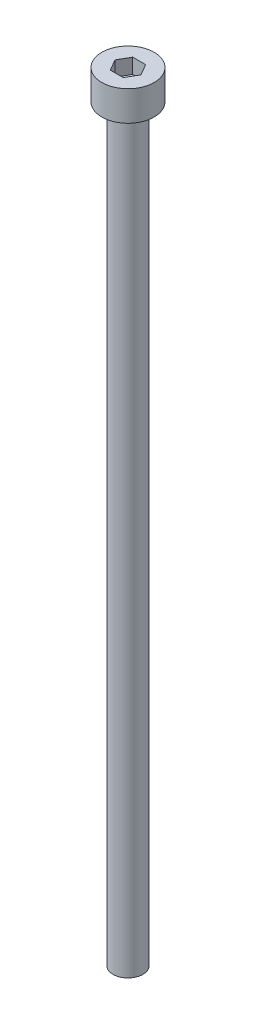
ISO-10303-21;
HEADER;
FILE_DESCRIPTION(('STEP AP214'),'2;1');
FILE_NAME('part.step','',(''),(''),'','','');
FILE_SCHEMA(('AUTOMOTIVE_DESIGN { 1 0 10303 214 1 1 1 1 }'));
ENDSEC;
DATA;
#1=APPLICATION_CONTEXT('core data for automotive mechanical design processes');
#2=APPLICATION_PROTOCOL_DEFINITION('international standard','automotive_design',2000,#1);
#3=PRODUCT_CONTEXT('',#1,'mechanical');
#4=PRODUCT('Part','Part','',(#3));
#5=PRODUCT_RELATED_PRODUCT_CATEGORY('part','',(#4));
#6=PRODUCT_DEFINITION_FORMATION('','',#4);
#7=PRODUCT_DEFINITION_CONTEXT('part definition',#1,'design');
#8=PRODUCT_DEFINITION('design','',#6,#7);
#9=PRODUCT_DEFINITION_SHAPE('','',#8);
#10=(LENGTH_UNIT() NAMED_UNIT(*) SI_UNIT(.MILLI.,.METRE.));
#11=(NAMED_UNIT(*) PLANE_ANGLE_UNIT() SI_UNIT($,.RADIAN.));
#12=(NAMED_UNIT(*) SI_UNIT($,.STERADIAN.) SOLID_ANGLE_UNIT());
#13=UNCERTAINTY_MEASURE_WITH_UNIT(LENGTH_MEASURE(1.E-05),#10,'distance_accuracy_value','');
#14=(GEOMETRIC_REPRESENTATION_CONTEXT(3) GLOBAL_UNCERTAINTY_ASSIGNED_CONTEXT((#13)) GLOBAL_UNIT_ASSIGNED_CONTEXT((#10,
#11,#12)) REPRESENTATION_CONTEXT('',''));
#15=CARTESIAN_POINT('',(0.,0.,0.));
#16=DIRECTION('',(0.,0.,1.));
#17=DIRECTION('',(1.,0.,0.));
#18=AXIS2_PLACEMENT_3D('',#15,#16,#17);
#19=CARTESIAN_POINT('',(0.,4.,0.));
#20=DIRECTION('',(0.,-1.,0.));
#21=DIRECTION('',(0.,0.,-1.));
#22=AXIS2_PLACEMENT_3D('',#19,#20,#21);
#23=CYLINDRICAL_SURFACE('',#22,3.5);
#24=CARTESIAN_POINT('',(0.,4.,0.));
#25=DIRECTION('',(0.,1.,0.));
#26=DIRECTION('',(0.,0.,1.));
#27=AXIS2_PLACEMENT_3D('',#24,#25,#26);
#28=CIRCLE('',#27,3.5);
#29=CARTESIAN_POINT('',(0.,4.,3.5));
#30=VERTEX_POINT('',#29);
#31=EDGE_CURVE('E43',#30,#30,#28,.T.);
#32=ORIENTED_EDGE('',*,*,#31,.F.);
#33=EDGE_LOOP('',(#32));
#34=FACE_BOUND('',#33,.T.);
#35=CARTESIAN_POINT('',(0.,0.,0.));
#36=DIRECTION('',(0.,1.,0.));
#37=DIRECTION('',(0.,0.,1.));
#38=AXIS2_PLACEMENT_3D('',#35,#36,#37);
#39=CIRCLE('',#38,3.5);
#40=CARTESIAN_POINT('',(0.,0.,3.5));
#41=VERTEX_POINT('',#40);
#42=EDGE_CURVE('E38',#41,#41,#39,.T.);
#43=ORIENTED_EDGE('',*,*,#42,.T.);
#44=EDGE_LOOP('',(#43));
#45=FACE_BOUND('',#44,.T.);
#46=ADVANCED_FACE('F35',(#34,#45),#23,.T.);
#47=CARTESIAN_POINT('',(0.,4.,0.));
#48=DIRECTION('',(0.,1.,0.));
#49=DIRECTION('',(0.,0.,1.));
#50=AXIS2_PLACEMENT_3D('',#47,#48,#49);
#51=PLANE('',#50);
#52=DIRECTION('',(0.5,0.,-0.866025403784439));
#53=VECTOR('',#52,1.);
#54=CARTESIAN_POINT('',(0.866025403784438,4.,1.5));
#55=LINE('',#54,#53);
#56=CARTESIAN_POINT('',(0.866025403784438,4.,1.5));
#57=VERTEX_POINT('',#56);
#58=CARTESIAN_POINT('',(1.73205080756888,4.,0.));
#59=VERTEX_POINT('',#58);
#60=EDGE_CURVE('E51',#57,#59,#55,.T.);
#61=ORIENTED_EDGE('',*,*,#60,.F.);
#62=DIRECTION('',(1.,0.,0.));
#63=VECTOR('',#62,1.);
#64=CARTESIAN_POINT('',(-0.866025403784439,4.,1.5));
#65=LINE('',#64,#63);
#66=CARTESIAN_POINT('',(-0.866025403784439,4.,1.5));
#67=VERTEX_POINT('',#66);
#68=EDGE_CURVE('E135',#67,#57,#65,.T.);
#69=ORIENTED_EDGE('',*,*,#68,.F.);
#70=DIRECTION('',(0.5,0.,0.866025403784438));
#71=VECTOR('',#70,1.);
#72=CARTESIAN_POINT('',(-1.73205080756888,4.,0.));
#73=LINE('',#72,#71);
#74=CARTESIAN_POINT('',(-1.73205080756888,4.,0.));
#75=VERTEX_POINT('',#74);
#76=EDGE_CURVE('E133',#75,#67,#73,.T.);
#77=ORIENTED_EDGE('',*,*,#76,.F.);
#78=DIRECTION('',(-0.5,0.,0.866025403784439));
#79=VECTOR('',#78,1.);
#80=CARTESIAN_POINT('',(-0.866025403784439,4.,-1.5));
#81=LINE('',#80,#79);
#82=CARTESIAN_POINT('',(-0.866025403784439,4.,-1.5));
#83=VERTEX_POINT('',#82);
#84=EDGE_CURVE('E99',#83,#75,#81,.T.);
#85=ORIENTED_EDGE('',*,*,#84,.F.);
#86=DIRECTION('',(-1.,0.,0.));
#87=VECTOR('',#86,1.);
#88=CARTESIAN_POINT('',(0.866025403784438,4.,-1.5));
#89=LINE('',#88,#87);
#90=CARTESIAN_POINT('',(0.866025403784438,4.,-1.5));
#91=VERTEX_POINT('',#90);
#92=EDGE_CURVE('E129',#91,#83,#89,.T.);
#93=ORIENTED_EDGE('',*,*,#92,.F.);
#94=DIRECTION('',(-0.5,0.,-0.866025403784439));
#95=VECTOR('',#94,1.);
#96=CARTESIAN_POINT('',(1.73205080756888,4.,0.));
#97=LINE('',#96,#95);
#98=EDGE_CURVE('E125',#59,#91,#97,.T.);
#99=ORIENTED_EDGE('',*,*,#98,.F.);
#100=EDGE_LOOP('',(#61,#69,#77,#85,#93,#99));
#101=FACE_BOUND('',#100,.T.);
#102=ORIENTED_EDGE('',*,*,#31,.T.);
#103=EDGE_LOOP('',(#102));
#104=FACE_BOUND('',#103,.T.);
#105=ADVANCED_FACE('F153',(#101,#104),#51,.T.);
#106=CARTESIAN_POINT('',(0.,0.,0.));
#107=DIRECTION('',(0.,1.,0.));
#108=DIRECTION('',(0.,0.,1.));
#109=AXIS2_PLACEMENT_3D('',#106,#107,#108);
#110=PLANE('',#109);
#111=CARTESIAN_POINT('',(0.,0.,0.));
#112=DIRECTION('',(0.,-1.,0.));
#113=DIRECTION('',(0.,0.,-1.));
#114=AXIS2_PLACEMENT_3D('',#111,#112,#113);
#115=CIRCLE('',#114,2.);
#116=CARTESIAN_POINT('',(0.,0.,-2.));
#117=VERTEX_POINT('',#116);
#118=EDGE_CURVE('E11',#117,#117,#115,.T.);
#119=ORIENTED_EDGE('',*,*,#118,.F.);
#120=EDGE_LOOP('',(#119));
#121=FACE_BOUND('',#120,.T.);
#122=ORIENTED_EDGE('',*,*,#42,.F.);
#123=EDGE_LOOP('',(#122));
#124=FACE_BOUND('',#123,.T.);
#125=ADVANCED_FACE('F150',(#121,#124),#110,.F.);
#126=CARTESIAN_POINT('',(0.866025403784438,2.,1.5));
#127=DIRECTION('',(0.866025403784439,0.,0.5));
#128=DIRECTION('',(0.5,0.,-0.866025403784439));
#129=AXIS2_PLACEMENT_3D('',#126,#127,#128);
#130=PLANE('',#129);
#131=ORIENTED_EDGE('',*,*,#60,.T.);
#132=DIRECTION('',(0.,1.,0.));
#133=VECTOR('',#132,1.);
#134=CARTESIAN_POINT('',(1.73205080756888,2.,0.));
#135=LINE('',#134,#133);
#136=CARTESIAN_POINT('',(1.73205080756888,2.,0.));
#137=VERTEX_POINT('',#136);
#138=EDGE_CURVE('E81',#137,#59,#135,.T.);
#139=ORIENTED_EDGE('',*,*,#138,.F.);
#140=DIRECTION('',(0.5,0.,-0.866025403784439));
#141=VECTOR('',#140,1.);
#142=CARTESIAN_POINT('',(0.866025403784438,2.,1.5));
#143=LINE('',#142,#141);
#144=CARTESIAN_POINT('',(0.866025403784438,2.,1.5));
#145=VERTEX_POINT('',#144);
#146=EDGE_CURVE('E137',#145,#137,#143,.T.);
#147=ORIENTED_EDGE('',*,*,#146,.F.);
#148=DIRECTION('',(0.,1.,0.));
#149=VECTOR('',#148,1.);
#150=CARTESIAN_POINT('',(0.866025403784438,2.,1.5));
#151=LINE('',#150,#149);
#152=EDGE_CURVE('E59',#145,#57,#151,.T.);
#153=ORIENTED_EDGE('',*,*,#152,.T.);
#154=EDGE_LOOP('',(#131,#139,#147,#153));
#155=FACE_BOUND('',#154,.T.);
#156=ADVANCED_FACE('F152',(#155),#130,.F.);
#157=CARTESIAN_POINT('',(-0.866025403784439,2.,1.5));
#158=DIRECTION('',(0.,0.,1.));
#159=DIRECTION('',(1.,0.,0.));
#160=AXIS2_PLACEMENT_3D('',#157,#158,#159);
#161=PLANE('',#160);
#162=ORIENTED_EDGE('',*,*,#68,.T.);
#163=ORIENTED_EDGE('',*,*,#152,.F.);
#164=DIRECTION('',(1.,0.,0.));
#165=VECTOR('',#164,1.);
#166=CARTESIAN_POINT('',(-0.866025403784439,2.,1.5));
#167=LINE('',#166,#165);
#168=CARTESIAN_POINT('',(-0.866025403784439,2.,1.5));
#169=VERTEX_POINT('',#168);
#170=EDGE_CURVE('E111',#169,#145,#167,.T.);
#171=ORIENTED_EDGE('',*,*,#170,.F.);
#172=DIRECTION('',(0.,1.,0.));
#173=VECTOR('',#172,1.);
#174=CARTESIAN_POINT('',(-0.866025403784439,2.,1.5));
#175=LINE('',#174,#173);
#176=EDGE_CURVE('E103',#169,#67,#175,.T.);
#177=ORIENTED_EDGE('',*,*,#176,.T.);
#178=EDGE_LOOP('',(#162,#163,#171,#177));
#179=FACE_BOUND('',#178,.T.);
#180=ADVANCED_FACE('F159',(#179),#161,.F.);
#181=CARTESIAN_POINT('',(-1.73205080756888,2.,0.));
#182=DIRECTION('',(-0.866025403784439,0.,0.5));
#183=DIRECTION('',(0.5,0.,0.866025403784438));
#184=AXIS2_PLACEMENT_3D('',#181,#182,#183);
#185=PLANE('',#184);
#186=ORIENTED_EDGE('',*,*,#76,.T.);
#187=ORIENTED_EDGE('',*,*,#176,.F.);
#188=DIRECTION('',(0.5,0.,0.866025403784438));
#189=VECTOR('',#188,1.);
#190=CARTESIAN_POINT('',(-1.73205080756888,2.,0.));
#191=LINE('',#190,#189);
#192=CARTESIAN_POINT('',(-1.73205080756888,2.,0.));
#193=VERTEX_POINT('',#192);
#194=EDGE_CURVE('E107',#193,#169,#191,.T.);
#195=ORIENTED_EDGE('',*,*,#194,.F.);
#196=DIRECTION('',(0.,1.,0.));
#197=VECTOR('',#196,1.);
#198=CARTESIAN_POINT('',(-1.73205080756888,2.,0.));
#199=LINE('',#198,#197);
#200=EDGE_CURVE('E92',#193,#75,#199,.T.);
#201=ORIENTED_EDGE('',*,*,#200,.T.);
#202=EDGE_LOOP('',(#186,#187,#195,#201));
#203=FACE_BOUND('',#202,.T.);
#204=ADVANCED_FACE('F108',(#203),#185,.F.);
#205=CARTESIAN_POINT('',(-0.866025403784439,2.,-1.5));
#206=DIRECTION('',(-0.866025403784439,0.,-0.5));
#207=DIRECTION('',(-0.5,0.,0.866025403784439));
#208=AXIS2_PLACEMENT_3D('',#205,#206,#207);
#209=PLANE('',#208);
#210=ORIENTED_EDGE('',*,*,#84,.T.);
#211=ORIENTED_EDGE('',*,*,#200,.F.);
#212=DIRECTION('',(-0.5,0.,0.866025403784439));
#213=VECTOR('',#212,1.);
#214=CARTESIAN_POINT('',(-0.866025403784439,2.,-1.5));
#215=LINE('',#214,#213);
#216=CARTESIAN_POINT('',(-0.866025403784439,2.,-1.5));
#217=VERTEX_POINT('',#216);
#218=EDGE_CURVE('E96',#217,#193,#215,.T.);
#219=ORIENTED_EDGE('',*,*,#218,.F.);
#220=DIRECTION('',(0.,1.,0.));
#221=VECTOR('',#220,1.);
#222=CARTESIAN_POINT('',(-0.866025403784439,2.,-1.5));
#223=LINE('',#222,#221);
#224=EDGE_CURVE('E104',#217,#83,#223,.T.);
#225=ORIENTED_EDGE('',*,*,#224,.T.);
#226=EDGE_LOOP('',(#210,#211,#219,#225));
#227=FACE_BOUND('',#226,.T.);
#228=ADVANCED_FACE('F94',(#227),#209,.F.);
#229=CARTESIAN_POINT('',(0.866025403784438,2.,-1.5));
#230=DIRECTION('',(0.,0.,-1.));
#231=DIRECTION('',(-1.,0.,0.));
#232=AXIS2_PLACEMENT_3D('',#229,#230,#231);
#233=PLANE('',#232);
#234=ORIENTED_EDGE('',*,*,#92,.T.);
#235=ORIENTED_EDGE('',*,*,#224,.F.);
#236=DIRECTION('',(-1.,0.,0.));
#237=VECTOR('',#236,1.);
#238=CARTESIAN_POINT('',(0.866025403784438,2.,-1.5));
#239=LINE('',#238,#237);
#240=CARTESIAN_POINT('',(0.866025403784438,2.,-1.5));
#241=VERTEX_POINT('',#240);
#242=EDGE_CURVE('E117',#241,#217,#239,.T.);
#243=ORIENTED_EDGE('',*,*,#242,.F.);
#244=DIRECTION('',(0.,1.,0.));
#245=VECTOR('',#244,1.);
#246=CARTESIAN_POINT('',(0.866025403784438,2.,-1.5));
#247=LINE('',#246,#245);
#248=EDGE_CURVE('E141',#241,#91,#247,.T.);
#249=ORIENTED_EDGE('',*,*,#248,.T.);
#250=EDGE_LOOP('',(#234,#235,#243,#249));
#251=FACE_BOUND('',#250,.T.);
#252=ADVANCED_FACE('F204',(#251),#233,.F.);
#253=CARTESIAN_POINT('',(1.73205080756888,2.,0.));
#254=DIRECTION('',(0.866025403784439,0.,-0.5));
#255=DIRECTION('',(-0.5,0.,-0.866025403784439));
#256=AXIS2_PLACEMENT_3D('',#253,#254,#255);
#257=PLANE('',#256);
#258=ORIENTED_EDGE('',*,*,#98,.T.);
#259=ORIENTED_EDGE('',*,*,#248,.F.);
#260=DIRECTION('',(-0.5,0.,-0.866025403784439));
#261=VECTOR('',#260,1.);
#262=CARTESIAN_POINT('',(1.73205080756888,2.,0.));
#263=LINE('',#262,#261);
#264=EDGE_CURVE('E119',#137,#241,#263,.T.);
#265=ORIENTED_EDGE('',*,*,#264,.F.);
#266=ORIENTED_EDGE('',*,*,#138,.T.);
#267=EDGE_LOOP('',(#258,#259,#265,#266));
#268=FACE_BOUND('',#267,.T.);
#269=ADVANCED_FACE('F213',(#268),#257,.F.);
#270=CARTESIAN_POINT('',(0.,2.,0.));
#271=DIRECTION('',(0.,1.,0.));
#272=DIRECTION('',(0.,0.,1.));
#273=AXIS2_PLACEMENT_3D('',#270,#271,#272);
#274=PLANE('',#273);
#275=ORIENTED_EDGE('',*,*,#146,.T.);
#276=ORIENTED_EDGE('',*,*,#264,.T.);
#277=ORIENTED_EDGE('',*,*,#242,.T.);
#278=ORIENTED_EDGE('',*,*,#218,.T.);
#279=ORIENTED_EDGE('',*,*,#194,.T.);
#280=ORIENTED_EDGE('',*,*,#170,.T.);
#281=EDGE_LOOP('',(#275,#276,#277,#278,#279,#280));
#282=FACE_BOUND('',#281,.T.);
#283=ADVANCED_FACE('F114',(#282),#274,.T.);
#284=CARTESIAN_POINT('',(0.,-100.,0.));
#285=DIRECTION('',(0.,1.,0.));
#286=DIRECTION('',(0.,0.,1.));
#287=AXIS2_PLACEMENT_3D('',#284,#285,#286);
#288=CYLINDRICAL_SURFACE('',#287,2.);
#289=CARTESIAN_POINT('',(0.,-100.,0.));
#290=DIRECTION('',(0.,-1.,0.));
#291=DIRECTION('',(0.,0.,-1.));
#292=AXIS2_PLACEMENT_3D('',#289,#290,#291);
#293=CIRCLE('',#292,2.);
#294=CARTESIAN_POINT('',(0.,-100.,-2.));
#295=VERTEX_POINT('',#294);
#296=EDGE_CURVE('E126',#295,#295,#293,.T.);
#297=ORIENTED_EDGE('',*,*,#296,.F.);
#298=EDGE_LOOP('',(#297));
#299=FACE_BOUND('',#298,.T.);
#300=ORIENTED_EDGE('',*,*,#118,.T.);
#301=EDGE_LOOP('',(#300));
#302=FACE_BOUND('',#301,.T.);
#303=ADVANCED_FACE('F231',(#299,#302),#288,.T.);
#304=CARTESIAN_POINT('',(0.,-100.,0.));
#305=DIRECTION('',(0.,-1.,0.));
#306=DIRECTION('',(0.,0.,-1.));
#307=AXIS2_PLACEMENT_3D('',#304,#305,#306);
#308=PLANE('',#307);
#309=ORIENTED_EDGE('',*,*,#296,.T.);
#310=EDGE_LOOP('',(#309));
#311=FACE_BOUND('',#310,.T.);
#312=ADVANCED_FACE('F244',(#311),#308,.T.);
#313=CLOSED_SHELL('',(#46,#105,#125,#156,#180,#204,#228,#252,#269,#283,#303,#312));
#314=MANIFOLD_SOLID_BREP('B2',#313);
#315=ADVANCED_BREP_SHAPE_REPRESENTATION('',(#18,#314),#14);
#316=SHAPE_DEFINITION_REPRESENTATION(#9,#315);
ENDSEC;
END-ISO-10303-21;
